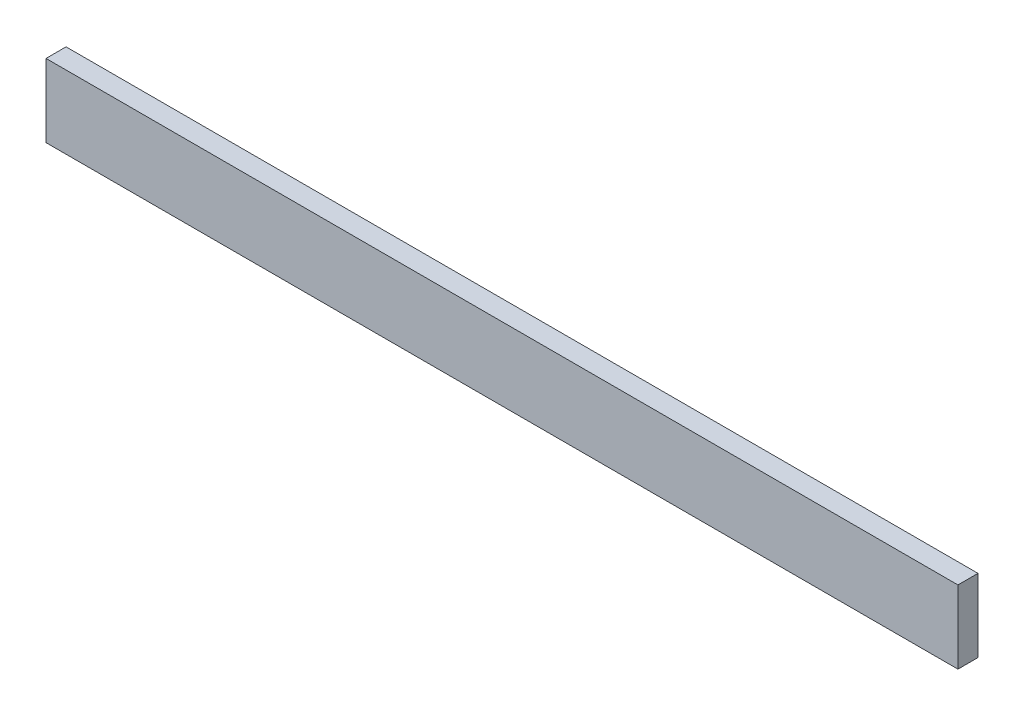
ISO-10303-21;
HEADER;
FILE_DESCRIPTION(('STEP AP214'),'2;1');
FILE_NAME('part.step','',(''),(''),'','','');
FILE_SCHEMA(('AUTOMOTIVE_DESIGN { 1 0 10303 214 1 1 1 1 }'));
ENDSEC;
DATA;
#1=APPLICATION_CONTEXT('core data for automotive mechanical design processes');
#2=APPLICATION_PROTOCOL_DEFINITION('international standard','automotive_design',2000,#1);
#3=PRODUCT_CONTEXT('',#1,'mechanical');
#4=PRODUCT('Part','Part','',(#3));
#5=PRODUCT_RELATED_PRODUCT_CATEGORY('part','',(#4));
#6=PRODUCT_DEFINITION_FORMATION('','',#4);
#7=PRODUCT_DEFINITION_CONTEXT('part definition',#1,'design');
#8=PRODUCT_DEFINITION('design','',#6,#7);
#9=PRODUCT_DEFINITION_SHAPE('','',#8);
#10=(LENGTH_UNIT() NAMED_UNIT(*) SI_UNIT(.MILLI.,.METRE.));
#11=(NAMED_UNIT(*) PLANE_ANGLE_UNIT() SI_UNIT($,.RADIAN.));
#12=(NAMED_UNIT(*) SI_UNIT($,.STERADIAN.) SOLID_ANGLE_UNIT());
#13=UNCERTAINTY_MEASURE_WITH_UNIT(LENGTH_MEASURE(1.E-05),#10,'distance_accuracy_value','');
#14=(GEOMETRIC_REPRESENTATION_CONTEXT(3) GLOBAL_UNCERTAINTY_ASSIGNED_CONTEXT((#13)) GLOBAL_UNIT_ASSIGNED_CONTEXT((#10,
#11,#12)) REPRESENTATION_CONTEXT('',''));
#15=CARTESIAN_POINT('',(0.,0.,0.));
#16=DIRECTION('',(0.,0.,1.));
#17=DIRECTION('',(1.,0.,0.));
#18=AXIS2_PLACEMENT_3D('',#15,#16,#17);
#19=CARTESIAN_POINT('',(0.,0.,22.));
#20=DIRECTION('',(1.,0.,0.));
#21=DIRECTION('',(0.,0.,-1.));
#22=AXIS2_PLACEMENT_3D('',#19,#20,#21);
#23=PLANE('',#22);
#24=DIRECTION('',(0.,-1.,0.));
#25=VECTOR('',#24,1.);
#26=CARTESIAN_POINT('',(0.,0.,0.));
#27=LINE('',#26,#25);
#28=CARTESIAN_POINT('',(0.,80.,0.));
#29=VERTEX_POINT('',#28);
#30=CARTESIAN_POINT('',(0.,0.,0.));
#31=VERTEX_POINT('',#30);
#32=EDGE_CURVE('E94',#29,#31,#27,.T.);
#33=ORIENTED_EDGE('',*,*,#32,.T.);
#34=DIRECTION('',(0.,0.,-1.));
#35=VECTOR('',#34,1.);
#36=CARTESIAN_POINT('',(0.,0.,22.));
#37=LINE('',#36,#35);
#38=CARTESIAN_POINT('',(0.,0.,22.));
#39=VERTEX_POINT('',#38);
#40=EDGE_CURVE('E11',#39,#31,#37,.T.);
#41=ORIENTED_EDGE('',*,*,#40,.F.);
#42=DIRECTION('',(0.,-1.,0.));
#43=VECTOR('',#42,1.);
#44=CARTESIAN_POINT('',(0.,0.,22.));
#45=LINE('',#44,#43);
#46=CARTESIAN_POINT('',(0.,80.,22.));
#47=VERTEX_POINT('',#46);
#48=EDGE_CURVE('E82',#47,#39,#45,.T.);
#49=ORIENTED_EDGE('',*,*,#48,.F.);
#50=DIRECTION('',(0.,0.,-1.));
#51=VECTOR('',#50,1.);
#52=CARTESIAN_POINT('',(0.,80.,22.));
#53=LINE('',#52,#51);
#54=EDGE_CURVE('E90',#47,#29,#53,.T.);
#55=ORIENTED_EDGE('',*,*,#54,.T.);
#56=EDGE_LOOP('',(#33,#41,#49,#55));
#57=FACE_BOUND('',#56,.T.);
#58=ADVANCED_FACE('F31',(#57),#23,.F.);
#59=CARTESIAN_POINT('',(0.,0.,22.));
#60=DIRECTION('',(0.,1.,0.));
#61=DIRECTION('',(0.,0.,1.));
#62=AXIS2_PLACEMENT_3D('',#59,#60,#61);
#63=PLANE('',#62);
#64=DIRECTION('',(1.,0.,0.));
#65=VECTOR('',#64,1.);
#66=CARTESIAN_POINT('',(0.,0.,0.));
#67=LINE('',#66,#65);
#68=CARTESIAN_POINT('',(1000.,0.,0.));
#69=VERTEX_POINT('',#68);
#70=EDGE_CURVE('E86',#31,#69,#67,.T.);
#71=ORIENTED_EDGE('',*,*,#70,.T.);
#72=DIRECTION('',(0.,0.,-1.));
#73=VECTOR('',#72,1.);
#74=CARTESIAN_POINT('',(1000.,0.,22.));
#75=LINE('',#74,#73);
#76=CARTESIAN_POINT('',(1000.,0.,22.));
#77=VERTEX_POINT('',#76);
#78=EDGE_CURVE('E39',#77,#69,#75,.T.);
#79=ORIENTED_EDGE('',*,*,#78,.F.);
#80=DIRECTION('',(1.,0.,0.));
#81=VECTOR('',#80,1.);
#82=CARTESIAN_POINT('',(0.,0.,22.));
#83=LINE('',#82,#81);
#84=EDGE_CURVE('E77',#39,#77,#83,.T.);
#85=ORIENTED_EDGE('',*,*,#84,.F.);
#86=ORIENTED_EDGE('',*,*,#40,.T.);
#87=EDGE_LOOP('',(#71,#79,#85,#86));
#88=FACE_BOUND('',#87,.T.);
#89=ADVANCED_FACE('F85',(#88),#63,.F.);
#90=CARTESIAN_POINT('',(1000.,0.,22.));
#91=DIRECTION('',(-1.,0.,0.));
#92=DIRECTION('',(0.,0.,1.));
#93=AXIS2_PLACEMENT_3D('',#90,#91,#92);
#94=PLANE('',#93);
#95=DIRECTION('',(0.,1.,0.));
#96=VECTOR('',#95,1.);
#97=CARTESIAN_POINT('',(1000.,0.,0.));
#98=LINE('',#97,#96);
#99=CARTESIAN_POINT('',(1000.,80.,0.));
#100=VERTEX_POINT('',#99);
#101=EDGE_CURVE('E64',#69,#100,#98,.T.);
#102=ORIENTED_EDGE('',*,*,#101,.T.);
#103=DIRECTION('',(0.,0.,-1.));
#104=VECTOR('',#103,1.);
#105=CARTESIAN_POINT('',(1000.,80.,22.));
#106=LINE('',#105,#104);
#107=CARTESIAN_POINT('',(1000.,80.,22.));
#108=VERTEX_POINT('',#107);
#109=EDGE_CURVE('E87',#108,#100,#106,.T.);
#110=ORIENTED_EDGE('',*,*,#109,.F.);
#111=DIRECTION('',(0.,1.,0.));
#112=VECTOR('',#111,1.);
#113=CARTESIAN_POINT('',(1000.,0.,22.));
#114=LINE('',#113,#112);
#115=EDGE_CURVE('E80',#77,#108,#114,.T.);
#116=ORIENTED_EDGE('',*,*,#115,.F.);
#117=ORIENTED_EDGE('',*,*,#78,.T.);
#118=EDGE_LOOP('',(#102,#110,#116,#117));
#119=FACE_BOUND('',#118,.T.);
#120=ADVANCED_FACE('F88',(#119),#94,.F.);
#121=CARTESIAN_POINT('',(0.,80.,22.));
#122=DIRECTION('',(0.,-1.,0.));
#123=DIRECTION('',(0.,0.,-1.));
#124=AXIS2_PLACEMENT_3D('',#121,#122,#123);
#125=PLANE('',#124);
#126=DIRECTION('',(-1.,0.,0.));
#127=VECTOR('',#126,1.);
#128=CARTESIAN_POINT('',(0.,80.,0.));
#129=LINE('',#128,#127);
#130=EDGE_CURVE('E70',#100,#29,#129,.T.);
#131=ORIENTED_EDGE('',*,*,#130,.T.);
#132=ORIENTED_EDGE('',*,*,#54,.F.);
#133=DIRECTION('',(-1.,0.,0.));
#134=VECTOR('',#133,1.);
#135=CARTESIAN_POINT('',(0.,80.,22.));
#136=LINE('',#135,#134);
#137=EDGE_CURVE('E47',#108,#47,#136,.T.);
#138=ORIENTED_EDGE('',*,*,#137,.F.);
#139=ORIENTED_EDGE('',*,*,#109,.T.);
#140=EDGE_LOOP('',(#131,#132,#138,#139));
#141=FACE_BOUND('',#140,.T.);
#142=ADVANCED_FACE('F101',(#141),#125,.F.);
#143=CARTESIAN_POINT('',(0.,80.,22.));
#144=DIRECTION('',(0.,0.,-1.));
#145=DIRECTION('',(-1.,0.,0.));
#146=AXIS2_PLACEMENT_3D('',#143,#144,#145);
#147=PLANE('',#146);
#148=ORIENTED_EDGE('',*,*,#48,.T.);
#149=ORIENTED_EDGE('',*,*,#84,.T.);
#150=ORIENTED_EDGE('',*,*,#115,.T.);
#151=ORIENTED_EDGE('',*,*,#137,.T.);
#152=EDGE_LOOP('',(#148,#149,#150,#151));
#153=FACE_BOUND('',#152,.T.);
#154=ADVANCED_FACE('F78',(#153),#147,.F.);
#155=CARTESIAN_POINT('',(0.,80.,0.));
#156=DIRECTION('',(0.,0.,-1.));
#157=DIRECTION('',(-1.,0.,0.));
#158=AXIS2_PLACEMENT_3D('',#155,#156,#157);
#159=PLANE('',#158);
#160=ORIENTED_EDGE('',*,*,#32,.F.);
#161=ORIENTED_EDGE('',*,*,#130,.F.);
#162=ORIENTED_EDGE('',*,*,#101,.F.);
#163=ORIENTED_EDGE('',*,*,#70,.F.);
#164=EDGE_LOOP('',(#160,#161,#162,#163));
#165=FACE_BOUND('',#164,.T.);
#166=ADVANCED_FACE('F104',(#165),#159,.T.);
#167=CLOSED_SHELL('',(#58,#89,#120,#142,#154,#166));
#168=MANIFOLD_SOLID_BREP('B2',#167);
#169=ADVANCED_BREP_SHAPE_REPRESENTATION('',(#18,#168),#14);
#170=SHAPE_DEFINITION_REPRESENTATION(#9,#169);
ENDSEC;
END-ISO-10303-21;
